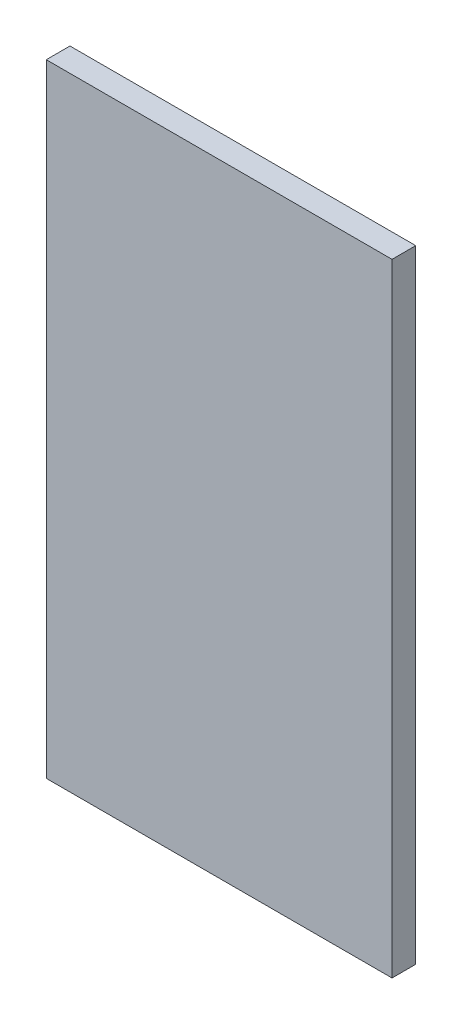
ISO-10303-21;
HEADER;
FILE_DESCRIPTION(('STEP AP214'),'2;1');
FILE_NAME('part.step','',(''),(''),'','','');
FILE_SCHEMA(('AUTOMOTIVE_DESIGN { 1 0 10303 214 1 1 1 1 }'));
ENDSEC;
DATA;
#1=APPLICATION_CONTEXT('core data for automotive mechanical design processes');
#2=APPLICATION_PROTOCOL_DEFINITION('international standard','automotive_design',2000,#1);
#3=PRODUCT_CONTEXT('',#1,'mechanical');
#4=PRODUCT('Part','Part','',(#3));
#5=PRODUCT_RELATED_PRODUCT_CATEGORY('part','',(#4));
#6=PRODUCT_DEFINITION_FORMATION('','',#4);
#7=PRODUCT_DEFINITION_CONTEXT('part definition',#1,'design');
#8=PRODUCT_DEFINITION('design','',#6,#7);
#9=PRODUCT_DEFINITION_SHAPE('','',#8);
#10=(LENGTH_UNIT() NAMED_UNIT(*) SI_UNIT(.MILLI.,.METRE.));
#11=(NAMED_UNIT(*) PLANE_ANGLE_UNIT() SI_UNIT($,.RADIAN.));
#12=(NAMED_UNIT(*) SI_UNIT($,.STERADIAN.) SOLID_ANGLE_UNIT());
#13=UNCERTAINTY_MEASURE_WITH_UNIT(LENGTH_MEASURE(1.E-05),#10,'distance_accuracy_value','');
#14=(GEOMETRIC_REPRESENTATION_CONTEXT(3) GLOBAL_UNCERTAINTY_ASSIGNED_CONTEXT((#13)) GLOBAL_UNIT_ASSIGNED_CONTEXT((#10,
#11,#12)) REPRESENTATION_CONTEXT('',''));
#15=CARTESIAN_POINT('',(0.,0.,0.));
#16=DIRECTION('',(0.,0.,1.));
#17=DIRECTION('',(1.,0.,0.));
#18=AXIS2_PLACEMENT_3D('',#15,#16,#17);
#19=CARTESIAN_POINT('',(8.20008,0.7,0.));
#20=DIRECTION('',(0.,0.,-1.));
#21=DIRECTION('',(-1.,0.,0.));
#22=AXIS2_PLACEMENT_3D('',#19,#20,#21);
#23=PLANE('',#22);
#24=DIRECTION('',(1.,0.,0.));
#25=VECTOR('',#24,1.);
#26=CARTESIAN_POINT('',(7.95008,1.15,0.));
#27=LINE('',#26,#25);
#28=CARTESIAN_POINT('',(7.95008,1.15,0.));
#29=VERTEX_POINT('',#28);
#30=CARTESIAN_POINT('',(8.45008,1.15,0.));
#31=VERTEX_POINT('',#30);
#32=EDGE_CURVE('E55',#29,#31,#27,.T.);
#33=ORIENTED_EDGE('',*,*,#32,.T.);
#34=DIRECTION('',(0.,1.,0.));
#35=VECTOR('',#34,1.);
#36=CARTESIAN_POINT('',(8.45008,1.15,0.));
#37=LINE('',#36,#35);
#38=CARTESIAN_POINT('',(8.45008,0.25,0.));
#39=VERTEX_POINT('',#38);
#40=EDGE_CURVE('E57',#31,#39,#37,.F.);
#41=ORIENTED_EDGE('',*,*,#40,.T.);
#42=DIRECTION('',(1.,0.,0.));
#43=VECTOR('',#42,1.);
#44=CARTESIAN_POINT('',(8.45008,0.25,0.));
#45=LINE('',#44,#43);
#46=CARTESIAN_POINT('',(7.95008,0.25,0.));
#47=VERTEX_POINT('',#46);
#48=EDGE_CURVE('E20',#39,#47,#45,.F.);
#49=ORIENTED_EDGE('',*,*,#48,.T.);
#50=DIRECTION('',(0.,1.,0.));
#51=VECTOR('',#50,1.);
#52=CARTESIAN_POINT('',(7.95008,0.25,0.));
#53=LINE('',#52,#51);
#54=EDGE_CURVE('E80',#47,#29,#53,.T.);
#55=ORIENTED_EDGE('',*,*,#54,.T.);
#56=EDGE_LOOP('',(#33,#41,#49,#55));
#57=FACE_BOUND('',#56,.T.);
#58=ADVANCED_FACE('F17',(#57),#23,.T.);
#59=CARTESIAN_POINT('',(8.45008,0.25,0.));
#60=DIRECTION('',(0.,1.,0.));
#61=DIRECTION('',(0.,0.,1.));
#62=AXIS2_PLACEMENT_3D('',#59,#60,#61);
#63=PLANE('',#62);
#64=DIRECTION('',(0.,0.,-1.));
#65=VECTOR('',#64,1.);
#66=CARTESIAN_POINT('',(7.95008,0.25,0.));
#67=LINE('',#66,#65);
#68=CARTESIAN_POINT('',(7.95008,0.25,0.03429));
#69=VERTEX_POINT('',#68);
#70=EDGE_CURVE('E68',#69,#47,#67,.T.);
#71=ORIENTED_EDGE('',*,*,#70,.T.);
#72=ORIENTED_EDGE('',*,*,#48,.F.);
#73=DIRECTION('',(0.,0.,1.));
#74=VECTOR('',#73,1.);
#75=CARTESIAN_POINT('',(8.45008,0.25,0.));
#76=LINE('',#75,#74);
#77=CARTESIAN_POINT('',(8.45008,0.25,0.03429));
#78=VERTEX_POINT('',#77);
#79=EDGE_CURVE('E63',#39,#78,#76,.T.);
#80=ORIENTED_EDGE('',*,*,#79,.T.);
#81=DIRECTION('',(1.,0.,0.));
#82=VECTOR('',#81,1.);
#83=CARTESIAN_POINT('',(8.20008,0.25,0.03429));
#84=LINE('',#83,#82);
#85=EDGE_CURVE('E83',#69,#78,#84,.T.);
#86=ORIENTED_EDGE('',*,*,#85,.F.);
#87=EDGE_LOOP('',(#71,#72,#80,#86));
#88=FACE_BOUND('',#87,.T.);
#89=ADVANCED_FACE('F65',(#88),#63,.F.);
#90=CARTESIAN_POINT('',(8.45008,1.15,0.));
#91=DIRECTION('',(-1.,0.,0.));
#92=DIRECTION('',(0.,0.,1.));
#93=AXIS2_PLACEMENT_3D('',#90,#91,#92);
#94=PLANE('',#93);
#95=ORIENTED_EDGE('',*,*,#79,.F.);
#96=ORIENTED_EDGE('',*,*,#40,.F.);
#97=DIRECTION('',(0.,0.,-1.));
#98=VECTOR('',#97,1.);
#99=CARTESIAN_POINT('',(8.45008,1.15,0.));
#100=LINE('',#99,#98);
#101=CARTESIAN_POINT('',(8.45008,1.15,0.03429));
#102=VERTEX_POINT('',#101);
#103=EDGE_CURVE('E75',#31,#102,#100,.F.);
#104=ORIENTED_EDGE('',*,*,#103,.T.);
#105=DIRECTION('',(0.,1.,0.));
#106=VECTOR('',#105,1.);
#107=CARTESIAN_POINT('',(8.45008,0.7,0.03429));
#108=LINE('',#107,#106);
#109=EDGE_CURVE('E72',#78,#102,#108,.T.);
#110=ORIENTED_EDGE('',*,*,#109,.F.);
#111=EDGE_LOOP('',(#95,#96,#104,#110));
#112=FACE_BOUND('',#111,.T.);
#113=ADVANCED_FACE('F70',(#112),#94,.F.);
#114=CARTESIAN_POINT('',(7.95008,1.15,0.));
#115=DIRECTION('',(0.,-1.,0.));
#116=DIRECTION('',(0.,0.,-1.));
#117=AXIS2_PLACEMENT_3D('',#114,#115,#116);
#118=PLANE('',#117);
#119=ORIENTED_EDGE('',*,*,#103,.F.);
#120=ORIENTED_EDGE('',*,*,#32,.F.);
#121=DIRECTION('',(0.,0.,-1.));
#122=VECTOR('',#121,1.);
#123=CARTESIAN_POINT('',(7.95008,1.15,0.));
#124=LINE('',#123,#122);
#125=CARTESIAN_POINT('',(7.95008,1.15,0.03429));
#126=VERTEX_POINT('',#125);
#127=EDGE_CURVE('E35',#29,#126,#124,.F.);
#128=ORIENTED_EDGE('',*,*,#127,.T.);
#129=DIRECTION('',(1.,0.,0.));
#130=VECTOR('',#129,1.);
#131=CARTESIAN_POINT('',(8.20008,1.15,0.03429));
#132=LINE('',#131,#130);
#133=EDGE_CURVE('E26',#102,#126,#132,.F.);
#134=ORIENTED_EDGE('',*,*,#133,.F.);
#135=EDGE_LOOP('',(#119,#120,#128,#134));
#136=FACE_BOUND('',#135,.T.);
#137=ADVANCED_FACE('F89',(#136),#118,.F.);
#138=CARTESIAN_POINT('',(7.95008,0.25,0.));
#139=DIRECTION('',(1.,0.,0.));
#140=DIRECTION('',(0.,0.,-1.));
#141=AXIS2_PLACEMENT_3D('',#138,#139,#140);
#142=PLANE('',#141);
#143=ORIENTED_EDGE('',*,*,#127,.F.);
#144=ORIENTED_EDGE('',*,*,#54,.F.);
#145=ORIENTED_EDGE('',*,*,#70,.F.);
#146=DIRECTION('',(0.,1.,0.));
#147=VECTOR('',#146,1.);
#148=CARTESIAN_POINT('',(7.95008,0.7,0.03429));
#149=LINE('',#148,#147);
#150=EDGE_CURVE('E11',#126,#69,#149,.F.);
#151=ORIENTED_EDGE('',*,*,#150,.F.);
#152=EDGE_LOOP('',(#143,#144,#145,#151));
#153=FACE_BOUND('',#152,.T.);
#154=ADVANCED_FACE('F91',(#153),#142,.F.);
#155=CARTESIAN_POINT('',(8.20008,0.7,0.03429));
#156=DIRECTION('',(0.,0.,1.));
#157=DIRECTION('',(1.,0.,0.));
#158=AXIS2_PLACEMENT_3D('',#155,#156,#157);
#159=PLANE('',#158);
#160=ORIENTED_EDGE('',*,*,#133,.T.);
#161=ORIENTED_EDGE('',*,*,#150,.T.);
#162=ORIENTED_EDGE('',*,*,#85,.T.);
#163=ORIENTED_EDGE('',*,*,#109,.T.);
#164=EDGE_LOOP('',(#160,#161,#162,#163));
#165=FACE_BOUND('',#164,.T.);
#166=ADVANCED_FACE('F88',(#165),#159,.T.);
#167=CLOSED_SHELL('',(#58,#89,#113,#137,#154,#166));
#168=MANIFOLD_SOLID_BREP('B1',#167);
#169=ADVANCED_BREP_SHAPE_REPRESENTATION('',(#18,#168),#14);
#170=SHAPE_DEFINITION_REPRESENTATION(#9,#169);
ENDSEC;
END-ISO-10303-21;
